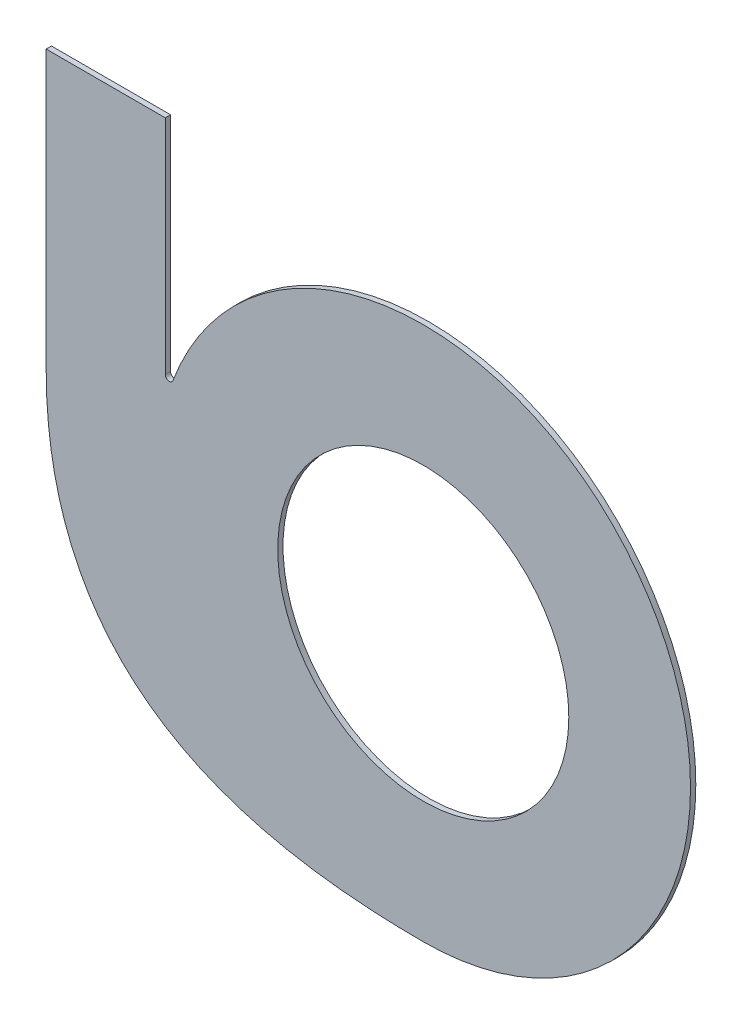
ISO-10303-21;
HEADER;
FILE_DESCRIPTION(('STEP AP214'),'2;1');
FILE_NAME('part.step','',(''),(''),'','','');
FILE_SCHEMA(('AUTOMOTIVE_DESIGN { 1 0 10303 214 1 1 1 1 }'));
ENDSEC;
DATA;
#1=APPLICATION_CONTEXT('core data for automotive mechanical design processes');
#2=APPLICATION_PROTOCOL_DEFINITION('international standard','automotive_design',2000,#1);
#3=PRODUCT_CONTEXT('',#1,'mechanical');
#4=PRODUCT('Part','Part','',(#3));
#5=PRODUCT_RELATED_PRODUCT_CATEGORY('part','',(#4));
#6=PRODUCT_DEFINITION_FORMATION('','',#4);
#7=PRODUCT_DEFINITION_CONTEXT('part definition',#1,'design');
#8=PRODUCT_DEFINITION('design','',#6,#7);
#9=PRODUCT_DEFINITION_SHAPE('','',#8);
#10=(LENGTH_UNIT() NAMED_UNIT(*) SI_UNIT(.MILLI.,.METRE.));
#11=(NAMED_UNIT(*) PLANE_ANGLE_UNIT() SI_UNIT($,.RADIAN.));
#12=(NAMED_UNIT(*) SI_UNIT($,.STERADIAN.) SOLID_ANGLE_UNIT());
#13=UNCERTAINTY_MEASURE_WITH_UNIT(LENGTH_MEASURE(1.E-05),#10,'distance_accuracy_value','');
#14=(GEOMETRIC_REPRESENTATION_CONTEXT(3) GLOBAL_UNCERTAINTY_ASSIGNED_CONTEXT((#13)) GLOBAL_UNIT_ASSIGNED_CONTEXT((#10,
#11,#12)) REPRESENTATION_CONTEXT('',''));
#15=CARTESIAN_POINT('',(0.,0.,0.));
#16=DIRECTION('',(0.,0.,1.));
#17=DIRECTION('',(1.,0.,0.));
#18=AXIS2_PLACEMENT_3D('',#15,#16,#17);
#19=CARTESIAN_POINT('',(-195.,239.840100222647,-4.));
#20=DIRECTION('',(0.,1.,0.));
#21=DIRECTION('',(-1.,0.,0.));
#22=AXIS2_PLACEMENT_3D('',#19,#20,#21);
#23=PLANE('',#22);
#24=DIRECTION('',(-1.,0.,0.));
#25=VECTOR('',#24,1.);
#26=CARTESIAN_POINT('',(-195.,239.840100222647,0.));
#27=LINE('',#26,#25);
#28=CARTESIAN_POINT('',(-195.,239.840100222647,0.));
#29=VERTEX_POINT('',#28);
#30=CARTESIAN_POINT('',(-285.,239.840100222647,0.));
#31=VERTEX_POINT('',#30);
#32=EDGE_CURVE('E136',#29,#31,#27,.T.);
#33=ORIENTED_EDGE('',*,*,#32,.F.);
#34=DIRECTION('',(0.,0.,1.));
#35=VECTOR('',#34,1.);
#36=CARTESIAN_POINT('',(-195.,239.840100222647,-4.));
#37=LINE('',#36,#35);
#38=CARTESIAN_POINT('',(-195.,239.840100222647,-4.));
#39=VERTEX_POINT('',#38);
#40=EDGE_CURVE('E11',#39,#29,#37,.T.);
#41=ORIENTED_EDGE('',*,*,#40,.F.);
#42=DIRECTION('',(-1.,0.,0.));
#43=VECTOR('',#42,1.);
#44=CARTESIAN_POINT('',(-195.,239.840100222647,-4.));
#45=LINE('',#44,#43);
#46=CARTESIAN_POINT('',(-285.,239.840100222647,-4.));
#47=VERTEX_POINT('',#46);
#48=EDGE_CURVE('E162',#39,#47,#45,.T.);
#49=ORIENTED_EDGE('',*,*,#48,.T.);
#50=DIRECTION('',(0.,0.,1.));
#51=VECTOR('',#50,1.);
#52=CARTESIAN_POINT('',(-285.,239.840100222647,-4.));
#53=LINE('',#52,#51);
#54=EDGE_CURVE('E44',#47,#31,#53,.T.);
#55=ORIENTED_EDGE('',*,*,#54,.T.);
#56=EDGE_LOOP('',(#33,#41,#49,#55));
#57=FACE_BOUND('',#56,.T.);
#58=ADVANCED_FACE('F41',(#57),#23,.T.);
#59=CARTESIAN_POINT('',(-195.,71.8401002226474,-4.));
#60=DIRECTION('',(1.,0.,0.));
#61=DIRECTION('',(0.,0.,-1.));
#62=AXIS2_PLACEMENT_3D('',#59,#60,#61);
#63=PLANE('',#62);
#64=DIRECTION('',(0.,1.,0.));
#65=VECTOR('',#64,1.);
#66=CARTESIAN_POINT('',(-195.,71.8401002226474,0.));
#67=LINE('',#66,#65);
#68=CARTESIAN_POINT('',(-195.,71.8401002226474,0.));
#69=VERTEX_POINT('',#68);
#70=EDGE_CURVE('E159',#69,#29,#67,.T.);
#71=ORIENTED_EDGE('',*,*,#70,.F.);
#72=DIRECTION('',(0.,0.,1.));
#73=VECTOR('',#72,1.);
#74=CARTESIAN_POINT('',(-195.,71.8401002226474,-4.));
#75=LINE('',#74,#73);
#76=CARTESIAN_POINT('',(-195.,71.8401002226474,-4.));
#77=VERTEX_POINT('',#76);
#78=EDGE_CURVE('E51',#77,#69,#75,.T.);
#79=ORIENTED_EDGE('',*,*,#78,.F.);
#80=DIRECTION('',(0.,1.,0.));
#81=VECTOR('',#80,1.);
#82=CARTESIAN_POINT('',(-195.,71.8401002226474,-4.));
#83=LINE('',#82,#81);
#84=EDGE_CURVE('E118',#77,#39,#83,.T.);
#85=ORIENTED_EDGE('',*,*,#84,.T.);
#86=ORIENTED_EDGE('',*,*,#40,.T.);
#87=EDGE_LOOP('',(#71,#79,#85,#86));
#88=FACE_BOUND('',#87,.T.);
#89=ADVANCED_FACE('F177',(#88),#63,.T.);
#90=CARTESIAN_POINT('',(-192.,71.8401002226474,-4.));
#91=DIRECTION('',(0.,0.,1.));
#92=DIRECTION('',(1.,0.,0.));
#93=AXIS2_PLACEMENT_3D('',#90,#91,#92);
#94=CYLINDRICAL_SURFACE('',#93,3.00000000000002);
#95=CARTESIAN_POINT('',(-192.,71.8401002226474,0.));
#96=DIRECTION('',(0.,0.,-1.));
#97=DIRECTION('',(1.,0.,0.));
#98=AXIS2_PLACEMENT_3D('',#95,#96,#97);
#99=CIRCLE('',#98,3.00000000000002);
#100=CARTESIAN_POINT('',(-189.190243902439,70.7887816828037,0.));
#101=VERTEX_POINT('',#100);
#102=EDGE_CURVE('E104',#101,#69,#99,.T.);
#103=ORIENTED_EDGE('',*,*,#102,.F.);
#104=DIRECTION('',(0.,0.,1.));
#105=VECTOR('',#104,1.);
#106=CARTESIAN_POINT('',(-189.190243902439,70.7887816828037,-4.));
#107=LINE('',#106,#105);
#108=CARTESIAN_POINT('',(-189.190243902439,70.7887816828037,-4.));
#109=VERTEX_POINT('',#108);
#110=EDGE_CURVE('E99',#109,#101,#107,.T.);
#111=ORIENTED_EDGE('',*,*,#110,.F.);
#112=CARTESIAN_POINT('',(-192.,71.8401002226474,-4.));
#113=DIRECTION('',(0.,0.,-1.));
#114=DIRECTION('',(1.,0.,0.));
#115=AXIS2_PLACEMENT_3D('',#112,#113,#114);
#116=CIRCLE('',#115,3.00000000000002);
#117=EDGE_CURVE('E102',#109,#77,#116,.T.);
#118=ORIENTED_EDGE('',*,*,#117,.T.);
#119=ORIENTED_EDGE('',*,*,#78,.T.);
#120=EDGE_LOOP('',(#103,#111,#118,#119));
#121=FACE_BOUND('',#120,.T.);
#122=ADVANCED_FACE('F101',(#121),#94,.F.);
#123=CARTESIAN_POINT('',(0.,0.,-4.));
#124=DIRECTION('',(0.,0.,1.));
#125=DIRECTION('',(1.,0.,0.));
#126=AXIS2_PLACEMENT_3D('',#123,#124,#125);
#127=CYLINDRICAL_SURFACE('',#126,202.);
#128=CARTESIAN_POINT('',(0.,0.,0.));
#129=DIRECTION('',(0.,0.,1.));
#130=DIRECTION('',(-1.,0.,0.));
#131=AXIS2_PLACEMENT_3D('',#128,#129,#130);
#132=CIRCLE('',#131,202.);
#133=CARTESIAN_POINT('',(0.,-202.,0.));
#134=VERTEX_POINT('',#133);
#135=EDGE_CURVE('E151',#134,#101,#132,.T.);
#136=ORIENTED_EDGE('',*,*,#135,.F.);
#137=DIRECTION('',(0.,0.,1.));
#138=VECTOR('',#137,1.);
#139=CARTESIAN_POINT('',(0.,-202.,-4.));
#140=LINE('',#139,#138);
#141=CARTESIAN_POINT('',(0.,-202.,-4.));
#142=VERTEX_POINT('',#141);
#143=EDGE_CURVE('E110',#142,#134,#140,.T.);
#144=ORIENTED_EDGE('',*,*,#143,.F.);
#145=CARTESIAN_POINT('',(0.,0.,-4.));
#146=DIRECTION('',(0.,0.,1.));
#147=DIRECTION('',(-1.,0.,0.));
#148=AXIS2_PLACEMENT_3D('',#145,#146,#147);
#149=CIRCLE('',#148,202.);
#150=EDGE_CURVE('E116',#142,#109,#149,.T.);
#151=ORIENTED_EDGE('',*,*,#150,.T.);
#152=ORIENTED_EDGE('',*,*,#110,.T.);
#153=EDGE_LOOP('',(#136,#144,#151,#152));
#154=FACE_BOUND('',#153,.T.);
#155=ADVANCED_FACE('F121',(#154),#127,.T.);
#156=CARTESIAN_POINT('',(-285.,29.8401002226472,-4.));
#157=CARTESIAN_POINT('',(-285.,-166.82656644402,-4.));
#158=CARTESIAN_POINT('',(-134.666666666666,-202.,-4.));
#159=CARTESIAN_POINT('',(0.,-202.,-4.));
#160=B_SPLINE_CURVE_WITH_KNOTS('',3,(#156,#157,#158,#159),.UNSPECIFIED.,.F.,.F.,(4,4),(0.,1.),.UNSPECIFIED.);
#161=DIRECTION('',(0.,0.,1.));
#162=VECTOR('',#161,1.);
#163=SURFACE_OF_LINEAR_EXTRUSION('',#160,#162);
#164=CARTESIAN_POINT('',(-285.,29.8401002226472,0.));
#165=CARTESIAN_POINT('',(-285.,-166.82656644402,0.));
#166=CARTESIAN_POINT('',(-134.666666666666,-202.,0.));
#167=CARTESIAN_POINT('',(0.,-202.,0.));
#168=B_SPLINE_CURVE_WITH_KNOTS('',3,(#164,#165,#166,#167),.UNSPECIFIED.,.F.,.F.,(4,4),(0.,1.),.UNSPECIFIED.);
#169=CARTESIAN_POINT('',(-285.,29.8401002226472,0.));
#170=VERTEX_POINT('',#169);
#171=EDGE_CURVE('E145',#170,#134,#168,.T.);
#172=ORIENTED_EDGE('',*,*,#171,.F.);
#173=DIRECTION('',(0.,0.,1.));
#174=VECTOR('',#173,1.);
#175=CARTESIAN_POINT('',(-285.,29.8401002226472,-4.));
#176=LINE('',#175,#174);
#177=CARTESIAN_POINT('',(-285.,29.8401002226472,-4.));
#178=VERTEX_POINT('',#177);
#179=EDGE_CURVE('E167',#178,#170,#176,.T.);
#180=ORIENTED_EDGE('',*,*,#179,.F.);
#181=EDGE_CURVE('E123',#178,#142,#160,.T.);
#182=ORIENTED_EDGE('',*,*,#181,.T.);
#183=ORIENTED_EDGE('',*,*,#143,.T.);
#184=EDGE_LOOP('',(#172,#180,#182,#183));
#185=FACE_BOUND('',#184,.T.);
#186=ADVANCED_FACE('F190',(#185),#163,.T.);
#187=CARTESIAN_POINT('',(-285.,239.840100222647,-4.));
#188=DIRECTION('',(-1.,0.,0.));
#189=DIRECTION('',(0.,0.,1.));
#190=AXIS2_PLACEMENT_3D('',#187,#188,#189);
#191=PLANE('',#190);
#192=DIRECTION('',(0.,-1.,0.));
#193=VECTOR('',#192,1.);
#194=CARTESIAN_POINT('',(-285.,239.840100222647,0.));
#195=LINE('',#194,#193);
#196=EDGE_CURVE('E140',#31,#170,#195,.T.);
#197=ORIENTED_EDGE('',*,*,#196,.F.);
#198=ORIENTED_EDGE('',*,*,#54,.F.);
#199=DIRECTION('',(0.,-1.,0.));
#200=VECTOR('',#199,1.);
#201=CARTESIAN_POINT('',(-285.,239.840100222647,-4.));
#202=LINE('',#201,#200);
#203=EDGE_CURVE('E127',#47,#178,#202,.T.);
#204=ORIENTED_EDGE('',*,*,#203,.T.);
#205=ORIENTED_EDGE('',*,*,#179,.T.);
#206=EDGE_LOOP('',(#197,#198,#204,#205));
#207=FACE_BOUND('',#206,.T.);
#208=ADVANCED_FACE('F174',(#207),#191,.T.);
#209=CARTESIAN_POINT('',(-193.,-159.829949888676,-4.));
#210=DIRECTION('',(0.,0.,-1.));
#211=DIRECTION('',(-1.,0.,0.));
#212=AXIS2_PLACEMENT_3D('',#209,#210,#211);
#213=PLANE('',#212);
#214=CARTESIAN_POINT('',(0.,0.,-4.));
#215=DIRECTION('',(0.,0.,1.));
#216=DIRECTION('',(1.,0.,0.));
#217=AXIS2_PLACEMENT_3D('',#214,#215,#216);
#218=CIRCLE('',#217,110.);
#219=CARTESIAN_POINT('',(110.,0.,-4.));
#220=VERTEX_POINT('',#219);
#221=EDGE_CURVE('E141',#220,#220,#218,.T.);
#222=ORIENTED_EDGE('',*,*,#221,.T.);
#223=EDGE_LOOP('',(#222));
#224=FACE_BOUND('',#223,.T.);
#225=ORIENTED_EDGE('',*,*,#48,.F.);
#226=ORIENTED_EDGE('',*,*,#84,.F.);
#227=ORIENTED_EDGE('',*,*,#117,.F.);
#228=ORIENTED_EDGE('',*,*,#150,.F.);
#229=ORIENTED_EDGE('',*,*,#181,.F.);
#230=ORIENTED_EDGE('',*,*,#203,.F.);
#231=EDGE_LOOP('',(#225,#226,#227,#228,#229,#230));
#232=FACE_BOUND('',#231,.T.);
#233=ADVANCED_FACE('F114',(#224,#232),#213,.T.);
#234=CARTESIAN_POINT('',(-193.,-159.829949888676,0.));
#235=DIRECTION('',(0.,0.,-1.));
#236=DIRECTION('',(-1.,0.,0.));
#237=AXIS2_PLACEMENT_3D('',#234,#235,#236);
#238=PLANE('',#237);
#239=CARTESIAN_POINT('',(0.,0.,0.));
#240=DIRECTION('',(0.,0.,1.));
#241=DIRECTION('',(1.,0.,0.));
#242=AXIS2_PLACEMENT_3D('',#239,#240,#241);
#243=CIRCLE('',#242,110.);
#244=CARTESIAN_POINT('',(110.,0.,0.));
#245=VERTEX_POINT('',#244);
#246=EDGE_CURVE('E213',#245,#245,#243,.T.);
#247=ORIENTED_EDGE('',*,*,#246,.F.);
#248=EDGE_LOOP('',(#247));
#249=FACE_BOUND('',#248,.T.);
#250=ORIENTED_EDGE('',*,*,#32,.T.);
#251=ORIENTED_EDGE('',*,*,#196,.T.);
#252=ORIENTED_EDGE('',*,*,#171,.T.);
#253=ORIENTED_EDGE('',*,*,#135,.T.);
#254=ORIENTED_EDGE('',*,*,#102,.T.);
#255=ORIENTED_EDGE('',*,*,#70,.T.);
#256=EDGE_LOOP('',(#250,#251,#252,#253,#254,#255));
#257=FACE_BOUND('',#256,.T.);
#258=ADVANCED_FACE('F176',(#249,#257),#238,.F.);
#259=CARTESIAN_POINT('',(0.,0.,-4.));
#260=DIRECTION('',(0.,0.,1.));
#261=DIRECTION('',(1.,0.,0.));
#262=AXIS2_PLACEMENT_3D('',#259,#260,#261);
#263=CYLINDRICAL_SURFACE('',#262,110.);
#264=ORIENTED_EDGE('',*,*,#221,.F.);
#265=EDGE_LOOP('',(#264));
#266=FACE_BOUND('',#265,.T.);
#267=ORIENTED_EDGE('',*,*,#246,.T.);
#268=EDGE_LOOP('',(#267));
#269=FACE_BOUND('',#268,.T.);
#270=ADVANCED_FACE('F201',(#266,#269),#263,.F.);
#271=CLOSED_SHELL('',(#58,#89,#122,#155,#186,#208,#233,#258,#270));
#272=MANIFOLD_SOLID_BREP('B2',#271);
#273=ADVANCED_BREP_SHAPE_REPRESENTATION('',(#18,#272),#14);
#274=SHAPE_DEFINITION_REPRESENTATION(#9,#273);
ENDSEC;
END-ISO-10303-21;
